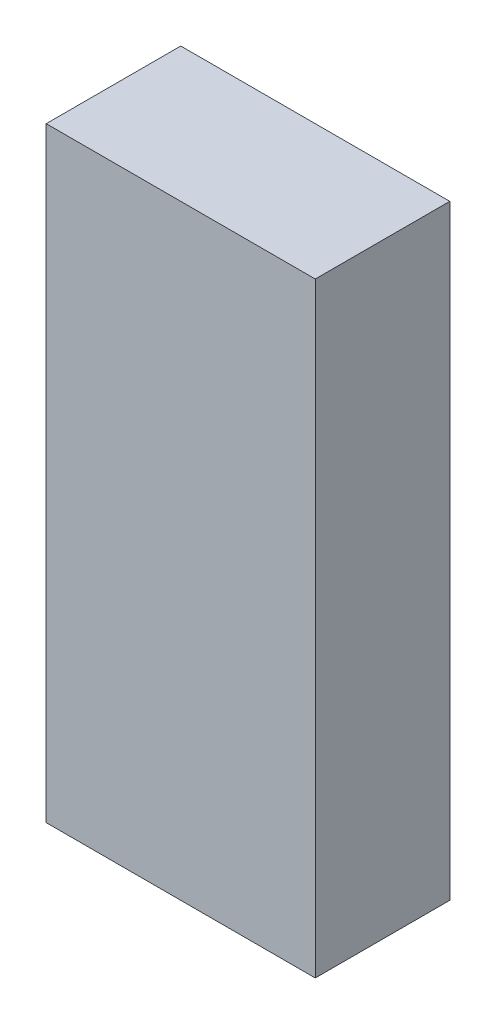
ISO-10303-21;
HEADER;
FILE_DESCRIPTION(('STEP AP214'),'2;1');
FILE_NAME('part.step','',(''),(''),'','','');
FILE_SCHEMA(('AUTOMOTIVE_DESIGN { 1 0 10303 214 1 1 1 1 }'));
ENDSEC;
DATA;
#1=APPLICATION_CONTEXT('core data for automotive mechanical design processes');
#2=APPLICATION_PROTOCOL_DEFINITION('international standard','automotive_design',2000,#1);
#3=PRODUCT_CONTEXT('',#1,'mechanical');
#4=PRODUCT('Part','Part','',(#3));
#5=PRODUCT_RELATED_PRODUCT_CATEGORY('part','',(#4));
#6=PRODUCT_DEFINITION_FORMATION('','',#4);
#7=PRODUCT_DEFINITION_CONTEXT('part definition',#1,'design');
#8=PRODUCT_DEFINITION('design','',#6,#7);
#9=PRODUCT_DEFINITION_SHAPE('','',#8);
#10=(LENGTH_UNIT() NAMED_UNIT(*) SI_UNIT(.MILLI.,.METRE.));
#11=(NAMED_UNIT(*) PLANE_ANGLE_UNIT() SI_UNIT($,.RADIAN.));
#12=(NAMED_UNIT(*) SI_UNIT($,.STERADIAN.) SOLID_ANGLE_UNIT());
#13=UNCERTAINTY_MEASURE_WITH_UNIT(LENGTH_MEASURE(1.E-05),#10,'distance_accuracy_value','');
#14=(GEOMETRIC_REPRESENTATION_CONTEXT(3) GLOBAL_UNCERTAINTY_ASSIGNED_CONTEXT((#13)) GLOBAL_UNIT_ASSIGNED_CONTEXT((#10,
#11,#12)) REPRESENTATION_CONTEXT('',''));
#15=CARTESIAN_POINT('',(0.,0.,0.));
#16=DIRECTION('',(0.,0.,1.));
#17=DIRECTION('',(1.,0.,0.));
#18=AXIS2_PLACEMENT_3D('',#15,#16,#17);
#19=CARTESIAN_POINT('',(-1.1,-2.975,0.));
#20=DIRECTION('',(1.,0.,0.));
#21=DIRECTION('',(0.,0.,1.));
#22=AXIS2_PLACEMENT_3D('',#19,#20,#21);
#23=PLANE('',#22);
#24=DIRECTION('',(0.,1.,0.));
#25=VECTOR('',#24,1.);
#26=CARTESIAN_POINT('',(-1.1,-2.975,0.1));
#27=LINE('',#26,#25);
#28=CARTESIAN_POINT('',(-1.1,-2.975,0.1));
#29=VERTEX_POINT('',#28);
#30=CARTESIAN_POINT('',(-1.1,-2.525,0.1));
#31=VERTEX_POINT('',#30);
#32=EDGE_CURVE('E11',#29,#31,#27,.T.);
#33=ORIENTED_EDGE('',*,*,#32,.T.);
#34=DIRECTION('',(0.,0.,1.));
#35=VECTOR('',#34,1.);
#36=CARTESIAN_POINT('',(-1.1,-2.525,0.));
#37=LINE('',#36,#35);
#38=CARTESIAN_POINT('',(-1.1,-2.525,0.));
#39=VERTEX_POINT('',#38);
#40=EDGE_CURVE('E24',#39,#31,#37,.T.);
#41=ORIENTED_EDGE('',*,*,#40,.F.);
#42=DIRECTION('',(0.,1.,0.));
#43=VECTOR('',#42,1.);
#44=CARTESIAN_POINT('',(-1.1,-2.975,0.));
#45=LINE('',#44,#43);
#46=CARTESIAN_POINT('',(-1.1,-2.975,0.));
#47=VERTEX_POINT('',#46);
#48=EDGE_CURVE('E86',#47,#39,#45,.T.);
#49=ORIENTED_EDGE('',*,*,#48,.F.);
#50=DIRECTION('',(0.,0.,1.));
#51=VECTOR('',#50,1.);
#52=CARTESIAN_POINT('',(-1.1,-2.975,0.));
#53=LINE('',#52,#51);
#54=EDGE_CURVE('E36',#47,#29,#53,.T.);
#55=ORIENTED_EDGE('',*,*,#54,.T.);
#56=EDGE_LOOP('',(#33,#41,#49,#55));
#57=FACE_BOUND('',#56,.T.);
#58=ADVANCED_FACE('F17',(#57),#23,.F.);
#59=CARTESIAN_POINT('',(-0.9,-2.975,0.));
#60=DIRECTION('',(1.,0.,0.));
#61=DIRECTION('',(0.,0.,1.));
#62=AXIS2_PLACEMENT_3D('',#59,#60,#61);
#63=PLANE('',#62);
#64=DIRECTION('',(0.,0.,1.));
#65=VECTOR('',#64,1.);
#66=CARTESIAN_POINT('',(-0.9,-2.975,0.));
#67=LINE('',#66,#65);
#68=CARTESIAN_POINT('',(-0.9,-2.975,0.));
#69=VERTEX_POINT('',#68);
#70=CARTESIAN_POINT('',(-0.9,-2.975,0.1));
#71=VERTEX_POINT('',#70);
#72=EDGE_CURVE('E83',#69,#71,#67,.T.);
#73=ORIENTED_EDGE('',*,*,#72,.F.);
#74=DIRECTION('',(0.,1.,0.));
#75=VECTOR('',#74,1.);
#76=CARTESIAN_POINT('',(-0.9,-2.975,0.));
#77=LINE('',#76,#75);
#78=CARTESIAN_POINT('',(-0.9,-2.525,0.));
#79=VERTEX_POINT('',#78);
#80=EDGE_CURVE('E63',#69,#79,#77,.T.);
#81=ORIENTED_EDGE('',*,*,#80,.T.);
#82=DIRECTION('',(0.,0.,1.));
#83=VECTOR('',#82,1.);
#84=CARTESIAN_POINT('',(-0.9,-2.525,0.));
#85=LINE('',#84,#83);
#86=CARTESIAN_POINT('',(-0.9,-2.525,0.1));
#87=VERTEX_POINT('',#86);
#88=EDGE_CURVE('E57',#79,#87,#85,.T.);
#89=ORIENTED_EDGE('',*,*,#88,.T.);
#90=DIRECTION('',(0.,1.,0.));
#91=VECTOR('',#90,1.);
#92=CARTESIAN_POINT('',(-0.9,-2.975,0.1));
#93=LINE('',#92,#91);
#94=EDGE_CURVE('E60',#71,#87,#93,.T.);
#95=ORIENTED_EDGE('',*,*,#94,.F.);
#96=EDGE_LOOP('',(#73,#81,#89,#95));
#97=FACE_BOUND('',#96,.T.);
#98=ADVANCED_FACE('F59',(#97),#63,.T.);
#99=CARTESIAN_POINT('',(-1.1,-2.975,0.));
#100=DIRECTION('',(0.,1.,0.));
#101=DIRECTION('',(0.,0.,1.));
#102=AXIS2_PLACEMENT_3D('',#99,#100,#101);
#103=PLANE('',#102);
#104=ORIENTED_EDGE('',*,*,#72,.T.);
#105=DIRECTION('',(1.,0.,0.));
#106=VECTOR('',#105,1.);
#107=CARTESIAN_POINT('',(-1.1,-2.975,0.1));
#108=LINE('',#107,#106);
#109=EDGE_CURVE('E71',#29,#71,#108,.T.);
#110=ORIENTED_EDGE('',*,*,#109,.F.);
#111=ORIENTED_EDGE('',*,*,#54,.F.);
#112=DIRECTION('',(1.,0.,0.));
#113=VECTOR('',#112,1.);
#114=CARTESIAN_POINT('',(-1.1,-2.975,0.));
#115=LINE('',#114,#113);
#116=EDGE_CURVE('E76',#47,#69,#115,.T.);
#117=ORIENTED_EDGE('',*,*,#116,.T.);
#118=EDGE_LOOP('',(#104,#110,#111,#117));
#119=FACE_BOUND('',#118,.T.);
#120=ADVANCED_FACE('F91',(#119),#103,.F.);
#121=CARTESIAN_POINT('',(-1.1,-2.525,0.));
#122=DIRECTION('',(0.,1.,0.));
#123=DIRECTION('',(0.,0.,1.));
#124=AXIS2_PLACEMENT_3D('',#121,#122,#123);
#125=PLANE('',#124);
#126=DIRECTION('',(1.,0.,0.));
#127=VECTOR('',#126,1.);
#128=CARTESIAN_POINT('',(-1.1,-2.525,0.));
#129=LINE('',#128,#127);
#130=EDGE_CURVE('E74',#39,#79,#129,.T.);
#131=ORIENTED_EDGE('',*,*,#130,.F.);
#132=ORIENTED_EDGE('',*,*,#40,.T.);
#133=DIRECTION('',(1.,0.,0.));
#134=VECTOR('',#133,1.);
#135=CARTESIAN_POINT('',(-1.1,-2.525,0.1));
#136=LINE('',#135,#134);
#137=EDGE_CURVE('E69',#31,#87,#136,.T.);
#138=ORIENTED_EDGE('',*,*,#137,.T.);
#139=ORIENTED_EDGE('',*,*,#88,.F.);
#140=EDGE_LOOP('',(#131,#132,#138,#139));
#141=FACE_BOUND('',#140,.T.);
#142=ADVANCED_FACE('F73',(#141),#125,.T.);
#143=CARTESIAN_POINT('',(-1.1,-2.975,0.));
#144=DIRECTION('',(0.,0.,1.));
#145=DIRECTION('',(1.,0.,0.));
#146=AXIS2_PLACEMENT_3D('',#143,#144,#145);
#147=PLANE('',#146);
#148=ORIENTED_EDGE('',*,*,#130,.T.);
#149=ORIENTED_EDGE('',*,*,#80,.F.);
#150=ORIENTED_EDGE('',*,*,#116,.F.);
#151=ORIENTED_EDGE('',*,*,#48,.T.);
#152=EDGE_LOOP('',(#148,#149,#150,#151));
#153=FACE_BOUND('',#152,.T.);
#154=ADVANCED_FACE('F89',(#153),#147,.F.);
#155=CARTESIAN_POINT('',(-1.1,-2.975,0.1));
#156=DIRECTION('',(0.,0.,1.));
#157=DIRECTION('',(1.,0.,0.));
#158=AXIS2_PLACEMENT_3D('',#155,#156,#157);
#159=PLANE('',#158);
#160=ORIENTED_EDGE('',*,*,#32,.F.);
#161=ORIENTED_EDGE('',*,*,#109,.T.);
#162=ORIENTED_EDGE('',*,*,#94,.T.);
#163=ORIENTED_EDGE('',*,*,#137,.F.);
#164=EDGE_LOOP('',(#160,#161,#162,#163));
#165=FACE_BOUND('',#164,.T.);
#166=ADVANCED_FACE('F68',(#165),#159,.T.);
#167=CLOSED_SHELL('',(#58,#98,#120,#142,#154,#166));
#168=MANIFOLD_SOLID_BREP('B1',#167);
#169=ADVANCED_BREP_SHAPE_REPRESENTATION('',(#18,#168),#14);
#170=SHAPE_DEFINITION_REPRESENTATION(#9,#169);
ENDSEC;
END-ISO-10303-21;
